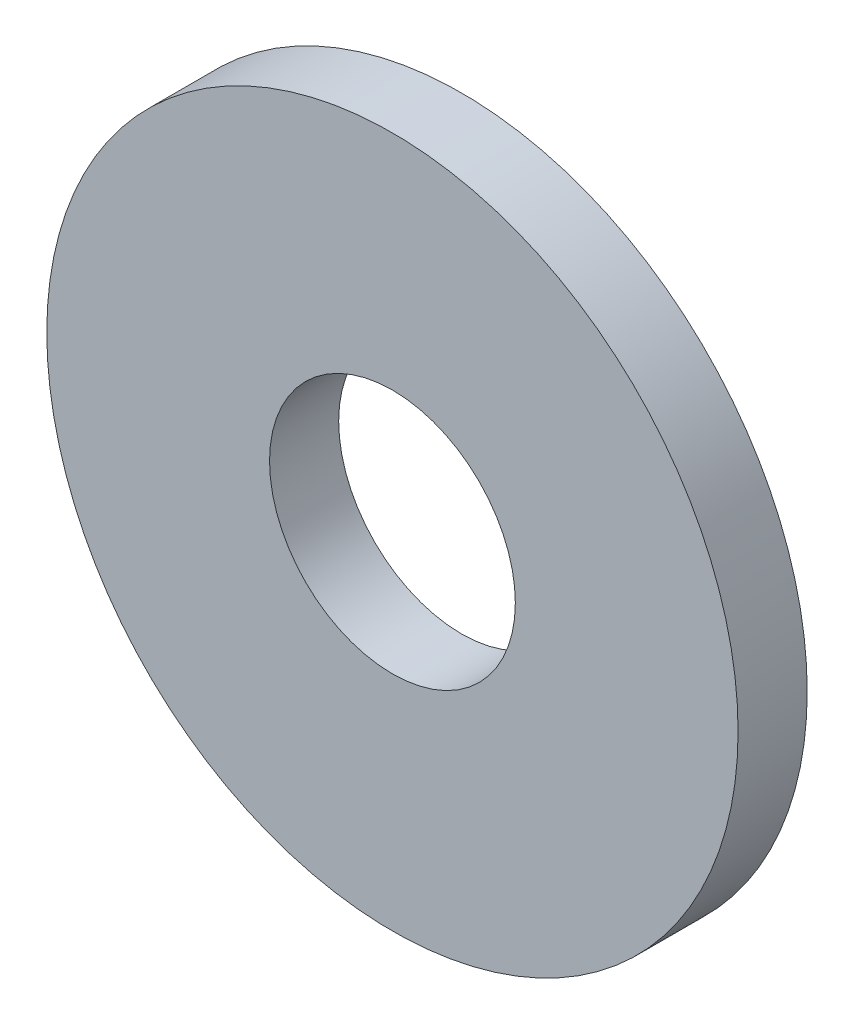
ISO-10303-21;
HEADER;
FILE_DESCRIPTION(('STEP AP214'),'2;1');
FILE_NAME('part.step','',(''),(''),'','','');
FILE_SCHEMA(('AUTOMOTIVE_DESIGN { 1 0 10303 214 1 1 1 1 }'));
ENDSEC;
DATA;
#1=APPLICATION_CONTEXT('core data for automotive mechanical design processes');
#2=APPLICATION_PROTOCOL_DEFINITION('international standard','automotive_design',2000,#1);
#3=PRODUCT_CONTEXT('',#1,'mechanical');
#4=PRODUCT('Part','Part','',(#3));
#5=PRODUCT_RELATED_PRODUCT_CATEGORY('part','',(#4));
#6=PRODUCT_DEFINITION_FORMATION('','',#4);
#7=PRODUCT_DEFINITION_CONTEXT('part definition',#1,'design');
#8=PRODUCT_DEFINITION('design','',#6,#7);
#9=PRODUCT_DEFINITION_SHAPE('','',#8);
#10=(LENGTH_UNIT() NAMED_UNIT(*) SI_UNIT(.MILLI.,.METRE.));
#11=(NAMED_UNIT(*) PLANE_ANGLE_UNIT() SI_UNIT($,.RADIAN.));
#12=(NAMED_UNIT(*) SI_UNIT($,.STERADIAN.) SOLID_ANGLE_UNIT());
#13=UNCERTAINTY_MEASURE_WITH_UNIT(LENGTH_MEASURE(1.E-05),#10,'distance_accuracy_value','');
#14=(GEOMETRIC_REPRESENTATION_CONTEXT(3) GLOBAL_UNCERTAINTY_ASSIGNED_CONTEXT((#13)) GLOBAL_UNIT_ASSIGNED_CONTEXT((#10,
#11,#12)) REPRESENTATION_CONTEXT('',''));
#15=CARTESIAN_POINT('',(0.,0.,0.));
#16=DIRECTION('',(0.,0.,1.));
#17=DIRECTION('',(1.,0.,0.));
#18=AXIS2_PLACEMENT_3D('',#15,#16,#17);
#19=CARTESIAN_POINT('',(0.,0.,0.9));
#20=DIRECTION('',(0.,0.,1.));
#21=DIRECTION('',(1.,0.,0.));
#22=AXIS2_PLACEMENT_3D('',#19,#20,#21);
#23=PLANE('',#22);
#24=CARTESIAN_POINT('',(0.,0.,0.9));
#25=DIRECTION('',(0.,0.,1.));
#26=DIRECTION('',(1.,0.,0.));
#27=AXIS2_PLACEMENT_3D('',#24,#25,#26);
#28=CIRCLE('',#27,4.5);
#29=CARTESIAN_POINT('',(4.5,0.,0.9));
#30=VERTEX_POINT('',#29);
#31=EDGE_CURVE('E10',#30,#30,#28,.T.);
#32=ORIENTED_EDGE('',*,*,#31,.T.);
#33=EDGE_LOOP('',(#32));
#34=FACE_BOUND('',#33,.T.);
#35=CARTESIAN_POINT('',(0.,0.,0.9));
#36=DIRECTION('',(0.,0.,1.));
#37=DIRECTION('',(1.,0.,0.));
#38=AXIS2_PLACEMENT_3D('',#35,#36,#37);
#39=CIRCLE('',#38,1.6);
#40=CARTESIAN_POINT('',(1.6,0.,0.9));
#41=VERTEX_POINT('',#40);
#42=EDGE_CURVE('E41',#41,#41,#39,.T.);
#43=ORIENTED_EDGE('',*,*,#42,.F.);
#44=EDGE_LOOP('',(#43));
#45=FACE_BOUND('',#44,.T.);
#46=ADVANCED_FACE('F30',(#34,#45),#23,.T.);
#47=CARTESIAN_POINT('',(0.,0.,0.));
#48=DIRECTION('',(0.,0.,1.));
#49=DIRECTION('',(1.,0.,0.));
#50=AXIS2_PLACEMENT_3D('',#47,#48,#49);
#51=PLANE('',#50);
#52=CARTESIAN_POINT('',(0.,0.,0.));
#53=DIRECTION('',(0.,0.,1.));
#54=DIRECTION('',(1.,0.,0.));
#55=AXIS2_PLACEMENT_3D('',#52,#53,#54);
#56=CIRCLE('',#55,4.5);
#57=CARTESIAN_POINT('',(4.5,0.,0.));
#58=VERTEX_POINT('',#57);
#59=EDGE_CURVE('E34',#58,#58,#56,.T.);
#60=ORIENTED_EDGE('',*,*,#59,.F.);
#61=EDGE_LOOP('',(#60));
#62=FACE_BOUND('',#61,.T.);
#63=CARTESIAN_POINT('',(0.,0.,0.));
#64=DIRECTION('',(0.,0.,1.));
#65=DIRECTION('',(1.,0.,0.));
#66=AXIS2_PLACEMENT_3D('',#63,#64,#65);
#67=CIRCLE('',#66,1.6);
#68=CARTESIAN_POINT('',(1.6,0.,0.));
#69=VERTEX_POINT('',#68);
#70=EDGE_CURVE('E43',#69,#69,#67,.T.);
#71=ORIENTED_EDGE('',*,*,#70,.T.);
#72=EDGE_LOOP('',(#71));
#73=FACE_BOUND('',#72,.T.);
#74=ADVANCED_FACE('F53',(#62,#73),#51,.F.);
#75=CARTESIAN_POINT('',(0.,0.,0.9));
#76=DIRECTION('',(0.,0.,-1.));
#77=DIRECTION('',(-1.,0.,0.));
#78=AXIS2_PLACEMENT_3D('',#75,#76,#77);
#79=CYLINDRICAL_SURFACE('',#78,4.5);
#80=ORIENTED_EDGE('',*,*,#31,.F.);
#81=EDGE_LOOP('',(#80));
#82=FACE_BOUND('',#81,.T.);
#83=ORIENTED_EDGE('',*,*,#59,.T.);
#84=EDGE_LOOP('',(#83));
#85=FACE_BOUND('',#84,.T.);
#86=ADVANCED_FACE('F32',(#82,#85),#79,.T.);
#87=CARTESIAN_POINT('',(0.,0.,0.9));
#88=DIRECTION('',(0.,0.,-1.));
#89=DIRECTION('',(-1.,0.,0.));
#90=AXIS2_PLACEMENT_3D('',#87,#88,#89);
#91=CYLINDRICAL_SURFACE('',#90,1.6);
#92=ORIENTED_EDGE('',*,*,#42,.T.);
#93=EDGE_LOOP('',(#92));
#94=FACE_BOUND('',#93,.T.);
#95=ORIENTED_EDGE('',*,*,#70,.F.);
#96=EDGE_LOOP('',(#95));
#97=FACE_BOUND('',#96,.T.);
#98=ADVANCED_FACE('F49',(#94,#97),#91,.F.);
#99=CLOSED_SHELL('',(#46,#74,#86,#98));
#100=MANIFOLD_SOLID_BREP('B2',#99);
#101=ADVANCED_BREP_SHAPE_REPRESENTATION('',(#18,#100),#14);
#102=SHAPE_DEFINITION_REPRESENTATION(#9,#101);
ENDSEC;
END-ISO-10303-21;
